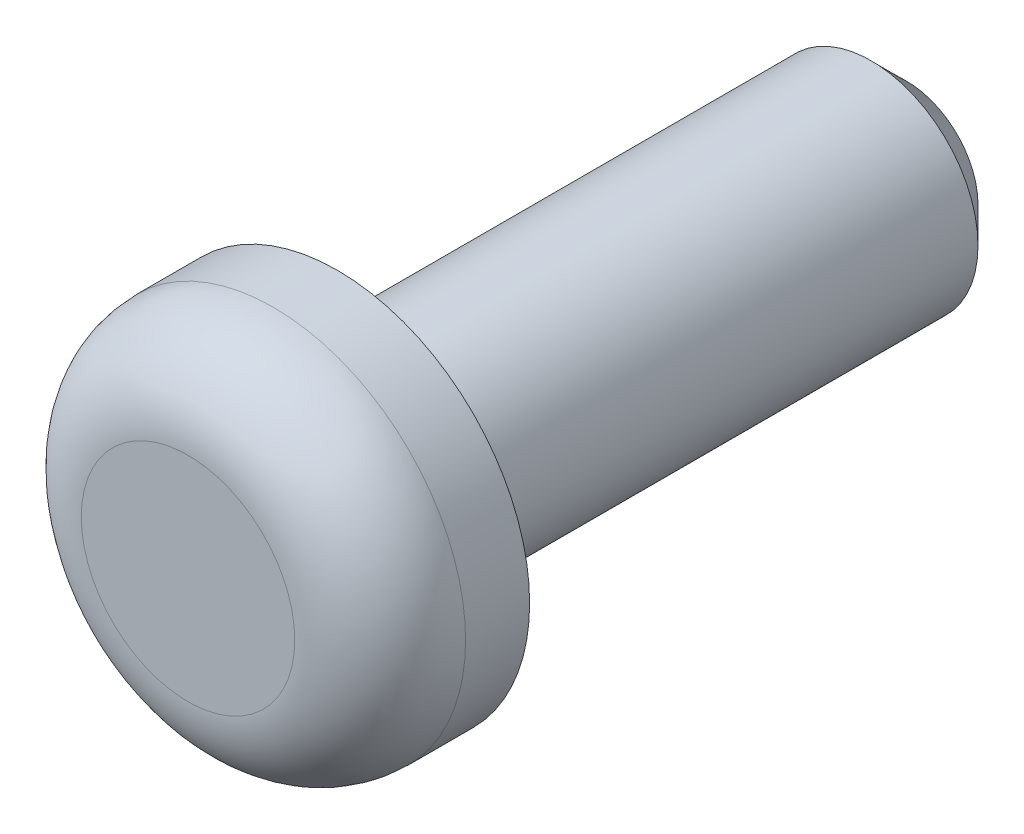
ISO-10303-21;
HEADER;
FILE_DESCRIPTION(('STEP AP214'),'2;1');
FILE_NAME('part.step','',(''),(''),'','','');
FILE_SCHEMA(('AUTOMOTIVE_DESIGN { 1 0 10303 214 1 1 1 1 }'));
ENDSEC;
DATA;
#1=APPLICATION_CONTEXT('core data for automotive mechanical design processes');
#2=APPLICATION_PROTOCOL_DEFINITION('international standard','automotive_design',2000,#1);
#3=PRODUCT_CONTEXT('',#1,'mechanical');
#4=PRODUCT('Part','Part','',(#3));
#5=PRODUCT_RELATED_PRODUCT_CATEGORY('part','',(#4));
#6=PRODUCT_DEFINITION_FORMATION('','',#4);
#7=PRODUCT_DEFINITION_CONTEXT('part definition',#1,'design');
#8=PRODUCT_DEFINITION('design','',#6,#7);
#9=PRODUCT_DEFINITION_SHAPE('','',#8);
#10=(LENGTH_UNIT() NAMED_UNIT(*) SI_UNIT(.MILLI.,.METRE.));
#11=(NAMED_UNIT(*) PLANE_ANGLE_UNIT() SI_UNIT($,.RADIAN.));
#12=(NAMED_UNIT(*) SI_UNIT($,.STERADIAN.) SOLID_ANGLE_UNIT());
#13=UNCERTAINTY_MEASURE_WITH_UNIT(LENGTH_MEASURE(1.E-05),#10,'distance_accuracy_value','');
#14=(GEOMETRIC_REPRESENTATION_CONTEXT(3) GLOBAL_UNCERTAINTY_ASSIGNED_CONTEXT((#13)) GLOBAL_UNIT_ASSIGNED_CONTEXT((#10,
#11,#12)) REPRESENTATION_CONTEXT('',''));
#15=CARTESIAN_POINT('',(0.,0.,0.));
#16=DIRECTION('',(0.,0.,1.));
#17=DIRECTION('',(1.,0.,0.));
#18=AXIS2_PLACEMENT_3D('',#15,#16,#17);
#19=CARTESIAN_POINT('',(0.,0.,0.));
#20=DIRECTION('',(0.,0.,1.));
#21=DIRECTION('',(1.,0.,0.));
#22=AXIS2_PLACEMENT_3D('',#19,#20,#21);
#23=CYLINDRICAL_SURFACE('',#22,2.7);
#24=CARTESIAN_POINT('',(0.,0.,0.9));
#25=DIRECTION('',(0.,0.,-1.));
#26=DIRECTION('',(-1.,0.,0.));
#27=AXIS2_PLACEMENT_3D('',#24,#25,#26);
#28=CIRCLE('',#27,2.7);
#29=CARTESIAN_POINT('',(-2.7,0.,0.9));
#30=VERTEX_POINT('',#29);
#31=EDGE_CURVE('E43',#30,#30,#28,.T.);
#32=ORIENTED_EDGE('',*,*,#31,.T.);
#33=EDGE_LOOP('',(#32));
#34=FACE_BOUND('',#33,.T.);
#35=CARTESIAN_POINT('',(0.,0.,0.));
#36=DIRECTION('',(0.,0.,1.));
#37=DIRECTION('',(1.,0.,0.));
#38=AXIS2_PLACEMENT_3D('',#35,#36,#37);
#39=CIRCLE('',#38,2.7);
#40=CARTESIAN_POINT('',(2.7,0.,0.));
#41=VERTEX_POINT('',#40);
#42=EDGE_CURVE('E52',#41,#41,#39,.T.);
#43=ORIENTED_EDGE('',*,*,#42,.T.);
#44=EDGE_LOOP('',(#43));
#45=FACE_BOUND('',#44,.T.);
#46=ADVANCED_FACE('F32',(#34,#45),#23,.T.);
#47=CARTESIAN_POINT('',(0.,2.7,0.));
#48=DIRECTION('',(0.,0.,1.));
#49=DIRECTION('',(1.,0.,0.));
#50=AXIS2_PLACEMENT_3D('',#47,#48,#49);
#51=PLANE('',#50);
#52=ORIENTED_EDGE('',*,*,#42,.F.);
#53=EDGE_LOOP('',(#52));
#54=FACE_BOUND('',#53,.T.);
#55=CARTESIAN_POINT('',(0.,0.,0.));
#56=DIRECTION('',(0.,0.,1.));
#57=DIRECTION('',(1.,0.,0.));
#58=AXIS2_PLACEMENT_3D('',#55,#56,#57);
#59=CIRCLE('',#58,1.5);
#60=CARTESIAN_POINT('',(1.5,0.,0.));
#61=VERTEX_POINT('',#60);
#62=EDGE_CURVE('E55',#61,#61,#59,.T.);
#63=ORIENTED_EDGE('',*,*,#62,.T.);
#64=EDGE_LOOP('',(#63));
#65=FACE_BOUND('',#64,.T.);
#66=ADVANCED_FACE('F59',(#54,#65),#51,.F.);
#67=CARTESIAN_POINT('',(0.,0.,0.));
#68=DIRECTION('',(0.,0.,1.));
#69=DIRECTION('',(1.,0.,0.));
#70=AXIS2_PLACEMENT_3D('',#67,#68,#69);
#71=CYLINDRICAL_SURFACE('',#70,1.5);
#72=CARTESIAN_POINT('',(0.,0.,-7.5));
#73=DIRECTION('',(0.,0.,1.));
#74=DIRECTION('',(1.,0.,0.));
#75=AXIS2_PLACEMENT_3D('',#72,#73,#74);
#76=CIRCLE('',#75,1.5);
#77=CARTESIAN_POINT('',(1.5,0.,-7.5));
#78=VERTEX_POINT('',#77);
#79=EDGE_CURVE('E39',#78,#78,#76,.T.);
#80=ORIENTED_EDGE('',*,*,#79,.T.);
#81=EDGE_LOOP('',(#80));
#82=FACE_BOUND('',#81,.T.);
#83=ORIENTED_EDGE('',*,*,#62,.F.);
#84=EDGE_LOOP('',(#83));
#85=FACE_BOUND('',#84,.T.);
#86=ADVANCED_FACE('F61',(#82,#85),#71,.T.);
#87=CARTESIAN_POINT('',(0.,1.5,-8.));
#88=DIRECTION('',(0.,0.,1.));
#89=DIRECTION('',(1.,0.,0.));
#90=AXIS2_PLACEMENT_3D('',#87,#88,#89);
#91=PLANE('',#90);
#92=CARTESIAN_POINT('',(0.,0.,-8.));
#93=DIRECTION('',(0.,0.,1.));
#94=DIRECTION('',(1.,0.,0.));
#95=AXIS2_PLACEMENT_3D('',#92,#93,#94);
#96=CIRCLE('',#95,0.999999999999997);
#97=CARTESIAN_POINT('',(0.999999999999997,0.,-8.));
#98=VERTEX_POINT('',#97);
#99=EDGE_CURVE('E10',#98,#98,#96,.F.);
#100=ORIENTED_EDGE('',*,*,#99,.T.);
#101=EDGE_LOOP('',(#100));
#102=FACE_BOUND('',#101,.T.);
#103=ADVANCED_FACE('F63',(#102),#91,.F.);
#104=CARTESIAN_POINT('',(0.,0.,2.1));
#105=DIRECTION('',(0.,0.,-1.));
#106=DIRECTION('',(-1.,0.,0.));
#107=AXIS2_PLACEMENT_3D('',#104,#105,#106);
#108=PLANE('',#107);
#109=CARTESIAN_POINT('',(0.,0.,2.1));
#110=DIRECTION('',(0.,0.,-1.));
#111=DIRECTION('',(-1.,0.,0.));
#112=AXIS2_PLACEMENT_3D('',#109,#110,#111);
#113=CIRCLE('',#112,1.5);
#114=CARTESIAN_POINT('',(-1.5,0.,2.1));
#115=VERTEX_POINT('',#114);
#116=EDGE_CURVE('E47',#115,#115,#113,.F.);
#117=ORIENTED_EDGE('',*,*,#116,.T.);
#118=EDGE_LOOP('',(#117));
#119=FACE_BOUND('',#118,.T.);
#120=ADVANCED_FACE('F69',(#119),#108,.F.);
#121=CARTESIAN_POINT('',(0.,0.,0.9));
#122=DIRECTION('',(0.,0.,-1.));
#123=DIRECTION('',(-1.,0.,0.));
#124=AXIS2_PLACEMENT_3D('',#121,#122,#123);
#125=TOROIDAL_SURFACE('',#124,1.5,1.2);
#126=ORIENTED_EDGE('',*,*,#31,.F.);
#127=EDGE_LOOP('',(#126));
#128=FACE_BOUND('',#127,.T.);
#129=ORIENTED_EDGE('',*,*,#116,.F.);
#130=EDGE_LOOP('',(#129));
#131=FACE_BOUND('',#130,.T.);
#132=ADVANCED_FACE('F79',(#128,#131),#125,.T.);
#133=CARTESIAN_POINT('',(0.,0.,-7.5));
#134=DIRECTION('',(0.,0.,1.));
#135=DIRECTION('',(1.,0.,0.));
#136=AXIS2_PLACEMENT_3D('',#133,#134,#135);
#137=CONICAL_SURFACE('',#136,1.5,0.78539816339745);
#138=ORIENTED_EDGE('',*,*,#99,.F.);
#139=EDGE_LOOP('',(#138));
#140=FACE_BOUND('',#139,.T.);
#141=ORIENTED_EDGE('',*,*,#79,.F.);
#142=EDGE_LOOP('',(#141));
#143=FACE_BOUND('',#142,.T.);
#144=ADVANCED_FACE('F34',(#140,#143),#137,.T.);
#145=CLOSED_SHELL('',(#46,#66,#86,#103,#120,#132,#144));
#146=MANIFOLD_SOLID_BREP('B2',#145);
#147=ADVANCED_BREP_SHAPE_REPRESENTATION('',(#18,#146),#14);
#148=SHAPE_DEFINITION_REPRESENTATION(#9,#147);
ENDSEC;
END-ISO-10303-21;
